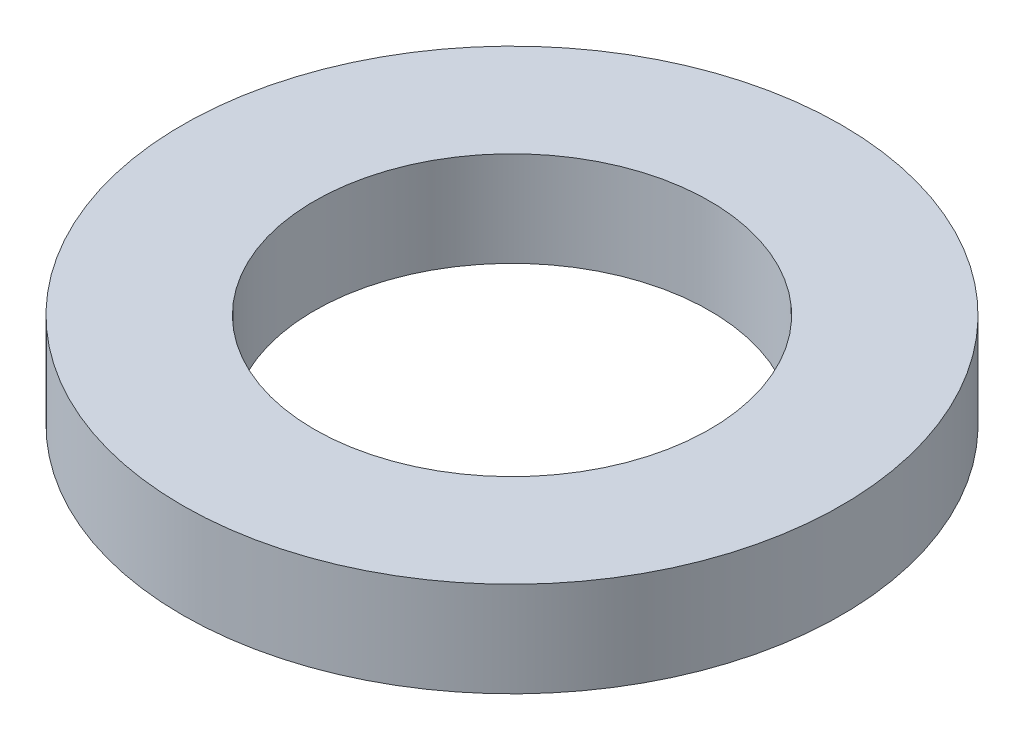
ISO-10303-21;
HEADER;
FILE_DESCRIPTION(('STEP AP214'),'2;1');
FILE_NAME('part.step','',(''),(''),'','','');
FILE_SCHEMA(('AUTOMOTIVE_DESIGN { 1 0 10303 214 1 1 1 1 }'));
ENDSEC;
DATA;
#1=APPLICATION_CONTEXT('core data for automotive mechanical design processes');
#2=APPLICATION_PROTOCOL_DEFINITION('international standard','automotive_design',2000,#1);
#3=PRODUCT_CONTEXT('',#1,'mechanical');
#4=PRODUCT('Part','Part','',(#3));
#5=PRODUCT_RELATED_PRODUCT_CATEGORY('part','',(#4));
#6=PRODUCT_DEFINITION_FORMATION('','',#4);
#7=PRODUCT_DEFINITION_CONTEXT('part definition',#1,'design');
#8=PRODUCT_DEFINITION('design','',#6,#7);
#9=PRODUCT_DEFINITION_SHAPE('','',#8);
#10=(LENGTH_UNIT() NAMED_UNIT(*) SI_UNIT(.MILLI.,.METRE.));
#11=(NAMED_UNIT(*) PLANE_ANGLE_UNIT() SI_UNIT($,.RADIAN.));
#12=(NAMED_UNIT(*) SI_UNIT($,.STERADIAN.) SOLID_ANGLE_UNIT());
#13=UNCERTAINTY_MEASURE_WITH_UNIT(LENGTH_MEASURE(1.E-05),#10,'distance_accuracy_value','');
#14=(GEOMETRIC_REPRESENTATION_CONTEXT(3) GLOBAL_UNCERTAINTY_ASSIGNED_CONTEXT((#13)) GLOBAL_UNIT_ASSIGNED_CONTEXT((#10,
#11,#12)) REPRESENTATION_CONTEXT('',''));
#15=CARTESIAN_POINT('',(0.,0.,0.));
#16=DIRECTION('',(0.,0.,1.));
#17=DIRECTION('',(1.,0.,0.));
#18=AXIS2_PLACEMENT_3D('',#15,#16,#17);
#19=CARTESIAN_POINT('',(0.,0.9,0.));
#20=DIRECTION('',(0.,1.,0.));
#21=DIRECTION('',(0.,0.,1.));
#22=AXIS2_PLACEMENT_3D('',#19,#20,#21);
#23=PLANE('',#22);
#24=CARTESIAN_POINT('',(0.,0.9,0.));
#25=DIRECTION('',(0.,1.,0.));
#26=DIRECTION('',(0.,0.,1.));
#27=AXIS2_PLACEMENT_3D('',#24,#25,#26);
#28=CIRCLE('',#27,6.25);
#29=CARTESIAN_POINT('',(0.,0.9,6.25));
#30=VERTEX_POINT('',#29);
#31=EDGE_CURVE('E10',#30,#30,#28,.T.);
#32=ORIENTED_EDGE('',*,*,#31,.T.);
#33=EDGE_LOOP('',(#32));
#34=FACE_BOUND('',#33,.T.);
#35=CARTESIAN_POINT('',(0.,0.9,0.));
#36=DIRECTION('',(0.,1.,0.));
#37=DIRECTION('',(0.,0.,1.));
#38=AXIS2_PLACEMENT_3D('',#35,#36,#37);
#39=CIRCLE('',#38,3.75);
#40=CARTESIAN_POINT('',(0.,0.9,3.75));
#41=VERTEX_POINT('',#40);
#42=EDGE_CURVE('E42',#41,#41,#39,.T.);
#43=ORIENTED_EDGE('',*,*,#42,.F.);
#44=EDGE_LOOP('',(#43));
#45=FACE_BOUND('',#44,.T.);
#46=ADVANCED_FACE('F31',(#34,#45),#23,.T.);
#47=CARTESIAN_POINT('',(0.,-0.9,0.));
#48=DIRECTION('',(0.,1.,0.));
#49=DIRECTION('',(0.,0.,1.));
#50=AXIS2_PLACEMENT_3D('',#47,#48,#49);
#51=PLANE('',#50);
#52=CARTESIAN_POINT('',(0.,-0.9,0.));
#53=DIRECTION('',(0.,1.,0.));
#54=DIRECTION('',(0.,0.,1.));
#55=AXIS2_PLACEMENT_3D('',#52,#53,#54);
#56=CIRCLE('',#55,6.25);
#57=CARTESIAN_POINT('',(0.,-0.9,6.25));
#58=VERTEX_POINT('',#57);
#59=EDGE_CURVE('E35',#58,#58,#56,.T.);
#60=ORIENTED_EDGE('',*,*,#59,.F.);
#61=EDGE_LOOP('',(#60));
#62=FACE_BOUND('',#61,.T.);
#63=CARTESIAN_POINT('',(0.,-0.9,0.));
#64=DIRECTION('',(0.,1.,0.));
#65=DIRECTION('',(0.,0.,1.));
#66=AXIS2_PLACEMENT_3D('',#63,#64,#65);
#67=CIRCLE('',#66,3.75);
#68=CARTESIAN_POINT('',(0.,-0.9,3.75));
#69=VERTEX_POINT('',#68);
#70=EDGE_CURVE('E44',#69,#69,#67,.T.);
#71=ORIENTED_EDGE('',*,*,#70,.T.);
#72=EDGE_LOOP('',(#71));
#73=FACE_BOUND('',#72,.T.);
#74=ADVANCED_FACE('F54',(#62,#73),#51,.F.);
#75=CARTESIAN_POINT('',(0.,0.9,0.));
#76=DIRECTION('',(0.,-1.,0.));
#77=DIRECTION('',(0.,0.,-1.));
#78=AXIS2_PLACEMENT_3D('',#75,#76,#77);
#79=CYLINDRICAL_SURFACE('',#78,6.25);
#80=ORIENTED_EDGE('',*,*,#31,.F.);
#81=EDGE_LOOP('',(#80));
#82=FACE_BOUND('',#81,.T.);
#83=ORIENTED_EDGE('',*,*,#59,.T.);
#84=EDGE_LOOP('',(#83));
#85=FACE_BOUND('',#84,.T.);
#86=ADVANCED_FACE('F33',(#82,#85),#79,.T.);
#87=CARTESIAN_POINT('',(0.,0.9,0.));
#88=DIRECTION('',(0.,-1.,0.));
#89=DIRECTION('',(0.,0.,-1.));
#90=AXIS2_PLACEMENT_3D('',#87,#88,#89);
#91=CYLINDRICAL_SURFACE('',#90,3.75);
#92=ORIENTED_EDGE('',*,*,#42,.T.);
#93=EDGE_LOOP('',(#92));
#94=FACE_BOUND('',#93,.T.);
#95=ORIENTED_EDGE('',*,*,#70,.F.);
#96=EDGE_LOOP('',(#95));
#97=FACE_BOUND('',#96,.T.);
#98=ADVANCED_FACE('F50',(#94,#97),#91,.F.);
#99=CLOSED_SHELL('',(#46,#74,#86,#98));
#100=MANIFOLD_SOLID_BREP('B2',#99);
#101=ADVANCED_BREP_SHAPE_REPRESENTATION('',(#18,#100),#14);
#102=SHAPE_DEFINITION_REPRESENTATION(#9,#101);
ENDSEC;
END-ISO-10303-21;
